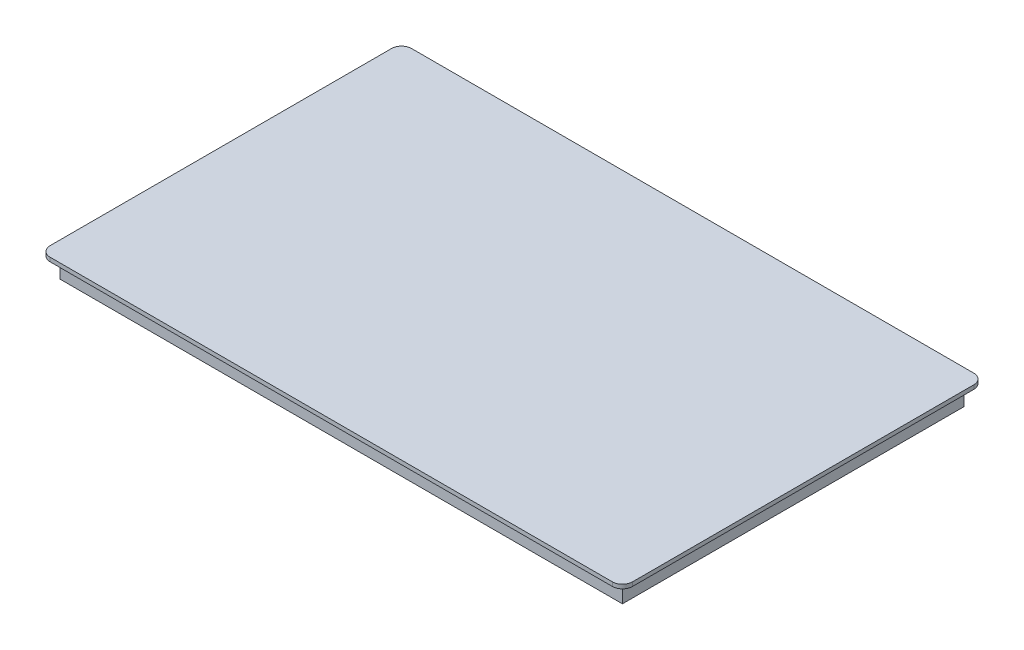
ISO-10303-21;
HEADER;
FILE_DESCRIPTION(('STEP AP214'),'2;1');
FILE_NAME('part.step','',(''),(''),'','','');
FILE_SCHEMA(('AUTOMOTIVE_DESIGN { 1 0 10303 214 1 1 1 1 }'));
ENDSEC;
DATA;
#1=APPLICATION_CONTEXT('core data for automotive mechanical design processes');
#2=APPLICATION_PROTOCOL_DEFINITION('international standard','automotive_design',2000,#1);
#3=PRODUCT_CONTEXT('',#1,'mechanical');
#4=PRODUCT('Part','Part','',(#3));
#5=PRODUCT_RELATED_PRODUCT_CATEGORY('part','',(#4));
#6=PRODUCT_DEFINITION_FORMATION('','',#4);
#7=PRODUCT_DEFINITION_CONTEXT('part definition',#1,'design');
#8=PRODUCT_DEFINITION('design','',#6,#7);
#9=PRODUCT_DEFINITION_SHAPE('','',#8);
#10=(LENGTH_UNIT() NAMED_UNIT(*) SI_UNIT(.MILLI.,.METRE.));
#11=(NAMED_UNIT(*) PLANE_ANGLE_UNIT() SI_UNIT($,.RADIAN.));
#12=(NAMED_UNIT(*) SI_UNIT($,.STERADIAN.) SOLID_ANGLE_UNIT());
#13=UNCERTAINTY_MEASURE_WITH_UNIT(LENGTH_MEASURE(1.E-05),#10,'distance_accuracy_value','');
#14=(GEOMETRIC_REPRESENTATION_CONTEXT(3) GLOBAL_UNCERTAINTY_ASSIGNED_CONTEXT((#13)) GLOBAL_UNIT_ASSIGNED_CONTEXT((#10,
#11,#12)) REPRESENTATION_CONTEXT('',''));
#15=CARTESIAN_POINT('',(0.,0.,0.));
#16=DIRECTION('',(0.,0.,1.));
#17=DIRECTION('',(1.,0.,0.));
#18=AXIS2_PLACEMENT_3D('',#15,#16,#17);
#19=CARTESIAN_POINT('',(0.,-1.,0.));
#20=DIRECTION('',(0.,1.,0.));
#21=DIRECTION('',(0.,0.,1.));
#22=AXIS2_PLACEMENT_3D('',#19,#20,#21);
#23=PLANE('',#22);
#24=DIRECTION('',(-1.,0.,0.));
#25=VECTOR('',#24,1.);
#26=CARTESIAN_POINT('',(-72.5,-1.,-45.));
#27=LINE('',#26,#25);
#28=CARTESIAN_POINT('',(70.,-1.,-45.));
#29=VERTEX_POINT('',#28);
#30=CARTESIAN_POINT('',(-70.,-1.,-45.));
#31=VERTEX_POINT('',#30);
#32=EDGE_CURVE('E263',#29,#31,#27,.T.);
#33=ORIENTED_EDGE('',*,*,#32,.F.);
#34=CARTESIAN_POINT('',(70.,-1.,-42.5));
#35=DIRECTION('',(0.,1.,0.));
#36=DIRECTION('',(0.,0.,1.));
#37=AXIS2_PLACEMENT_3D('',#34,#35,#36);
#38=CIRCLE('',#37,2.5);
#39=CARTESIAN_POINT('',(72.5,-1.,-42.5));
#40=VERTEX_POINT('',#39);
#41=EDGE_CURVE('E323',#29,#40,#38,.F.);
#42=ORIENTED_EDGE('',*,*,#41,.T.);
#43=DIRECTION('',(0.,0.,-1.));
#44=VECTOR('',#43,1.);
#45=CARTESIAN_POINT('',(72.5,-1.,-45.));
#46=LINE('',#45,#44);
#47=CARTESIAN_POINT('',(72.5000000000001,-1.,42.5));
#48=VERTEX_POINT('',#47);
#49=EDGE_CURVE('E259',#48,#40,#46,.T.);
#50=ORIENTED_EDGE('',*,*,#49,.F.);
#51=CARTESIAN_POINT('',(70.,-1.,42.5));
#52=DIRECTION('',(0.,1.,0.));
#53=DIRECTION('',(0.,0.,1.));
#54=AXIS2_PLACEMENT_3D('',#51,#52,#53);
#55=CIRCLE('',#54,2.5);
#56=CARTESIAN_POINT('',(70.,-1.,45.));
#57=VERTEX_POINT('',#56);
#58=EDGE_CURVE('E320',#48,#57,#55,.F.);
#59=ORIENTED_EDGE('',*,*,#58,.T.);
#60=DIRECTION('',(1.,0.,0.));
#61=VECTOR('',#60,1.);
#62=CARTESIAN_POINT('',(-72.4999999999999,-1.,45.));
#63=LINE('',#62,#61);
#64=CARTESIAN_POINT('',(-69.9999999999999,-1.,45.));
#65=VERTEX_POINT('',#64);
#66=EDGE_CURVE('E271',#65,#57,#63,.T.);
#67=ORIENTED_EDGE('',*,*,#66,.F.);
#68=CARTESIAN_POINT('',(-69.9999999999999,-1.,42.5));
#69=DIRECTION('',(0.,1.,0.));
#70=DIRECTION('',(0.,0.,1.));
#71=AXIS2_PLACEMENT_3D('',#68,#69,#70);
#72=CIRCLE('',#71,2.5);
#73=CARTESIAN_POINT('',(-72.4999999999999,-1.,42.5));
#74=VERTEX_POINT('',#73);
#75=EDGE_CURVE('E61',#65,#74,#72,.F.);
#76=ORIENTED_EDGE('',*,*,#75,.T.);
#77=DIRECTION('',(0.,0.,1.));
#78=VECTOR('',#77,1.);
#79=CARTESIAN_POINT('',(-72.5,-1.,-45.));
#80=LINE('',#79,#78);
#81=CARTESIAN_POINT('',(-72.5,-1.,-42.5));
#82=VERTEX_POINT('',#81);
#83=EDGE_CURVE('E268',#82,#74,#80,.T.);
#84=ORIENTED_EDGE('',*,*,#83,.F.);
#85=CARTESIAN_POINT('',(-70.,-1.,-42.5));
#86=DIRECTION('',(0.,1.,0.));
#87=DIRECTION('',(0.,0.,1.));
#88=AXIS2_PLACEMENT_3D('',#85,#86,#87);
#89=CIRCLE('',#88,2.5);
#90=EDGE_CURVE('E317',#82,#31,#89,.F.);
#91=ORIENTED_EDGE('',*,*,#90,.T.);
#92=EDGE_LOOP('',(#33,#42,#50,#59,#67,#76,#84,#91));
#93=FACE_BOUND('',#92,.T.);
#94=DIRECTION('',(0.,0.,1.));
#95=VECTOR('',#94,1.);
#96=CARTESIAN_POINT('',(70.,-1.,42.5));
#97=LINE('',#96,#95);
#98=CARTESIAN_POINT('',(70.,-1.,-42.5));
#99=VERTEX_POINT('',#98);
#100=CARTESIAN_POINT('',(70.,-1.,42.5));
#101=VERTEX_POINT('',#100);
#102=EDGE_CURVE('E180',#99,#101,#97,.T.);
#103=ORIENTED_EDGE('',*,*,#102,.F.);
#104=DIRECTION('',(1.,0.,0.));
#105=VECTOR('',#104,1.);
#106=CARTESIAN_POINT('',(-70.,-1.,-42.5));
#107=LINE('',#106,#105);
#108=CARTESIAN_POINT('',(-70.,-1.,-42.5));
#109=VERTEX_POINT('',#108);
#110=EDGE_CURVE('E219',#109,#99,#107,.T.);
#111=ORIENTED_EDGE('',*,*,#110,.F.);
#112=DIRECTION('',(0.,0.,-1.));
#113=VECTOR('',#112,1.);
#114=CARTESIAN_POINT('',(-70.,-1.,42.5));
#115=LINE('',#114,#113);
#116=CARTESIAN_POINT('',(-70.,-1.,42.5));
#117=VERTEX_POINT('',#116);
#118=EDGE_CURVE('E236',#117,#109,#115,.T.);
#119=ORIENTED_EDGE('',*,*,#118,.F.);
#120=DIRECTION('',(-1.,0.,0.));
#121=VECTOR('',#120,1.);
#122=CARTESIAN_POINT('',(-70.,-1.,42.5));
#123=LINE('',#122,#121);
#124=EDGE_CURVE('E232',#101,#117,#123,.T.);
#125=ORIENTED_EDGE('',*,*,#124,.F.);
#126=EDGE_LOOP('',(#103,#111,#119,#125));
#127=FACE_BOUND('',#126,.T.);
#128=ADVANCED_FACE('F45',(#93,#127),#23,.F.);
#129=CARTESIAN_POINT('',(72.5,-1.,-45.));
#130=DIRECTION('',(1.,0.,0.));
#131=DIRECTION('',(0.,0.,-1.));
#132=AXIS2_PLACEMENT_3D('',#129,#130,#131);
#133=PLANE('',#132);
#134=ORIENTED_EDGE('',*,*,#49,.T.);
#135=DIRECTION('',(0.,1.,0.));
#136=VECTOR('',#135,1.);
#137=CARTESIAN_POINT('',(72.5,-1.,-42.5));
#138=LINE('',#137,#136);
#139=CARTESIAN_POINT('',(72.5,0.,-42.5));
#140=VERTEX_POINT('',#139);
#141=EDGE_CURVE('E292',#40,#140,#138,.T.);
#142=ORIENTED_EDGE('',*,*,#141,.T.);
#143=DIRECTION('',(0.,0.,-1.));
#144=VECTOR('',#143,1.);
#145=CARTESIAN_POINT('',(72.5,0.,-45.));
#146=LINE('',#145,#144);
#147=CARTESIAN_POINT('',(72.5000000000001,0.,42.5));
#148=VERTEX_POINT('',#147);
#149=EDGE_CURVE('E258',#148,#140,#146,.T.);
#150=ORIENTED_EDGE('',*,*,#149,.F.);
#151=DIRECTION('',(0.,1.,0.));
#152=VECTOR('',#151,1.);
#153=CARTESIAN_POINT('',(72.5000000000001,-1.,42.5));
#154=LINE('',#153,#152);
#155=EDGE_CURVE('E275',#148,#48,#154,.F.);
#156=ORIENTED_EDGE('',*,*,#155,.T.);
#157=EDGE_LOOP('',(#134,#142,#150,#156));
#158=FACE_BOUND('',#157,.T.);
#159=ADVANCED_FACE('F357',(#158),#133,.T.);
#160=CARTESIAN_POINT('',(-72.4999999999999,-1.,45.));
#161=DIRECTION('',(0.,0.,1.));
#162=DIRECTION('',(1.,0.,0.));
#163=AXIS2_PLACEMENT_3D('',#160,#161,#162);
#164=PLANE('',#163);
#165=ORIENTED_EDGE('',*,*,#66,.T.);
#166=DIRECTION('',(0.,1.,0.));
#167=VECTOR('',#166,1.);
#168=CARTESIAN_POINT('',(70.,-1.,45.));
#169=LINE('',#168,#167);
#170=CARTESIAN_POINT('',(70.,0.,45.));
#171=VERTEX_POINT('',#170);
#172=EDGE_CURVE('E329',#57,#171,#169,.T.);
#173=ORIENTED_EDGE('',*,*,#172,.T.);
#174=DIRECTION('',(1.,0.,0.));
#175=VECTOR('',#174,1.);
#176=CARTESIAN_POINT('',(-72.4999999999999,0.,45.));
#177=LINE('',#176,#175);
#178=CARTESIAN_POINT('',(-69.9999999999999,0.,45.));
#179=VERTEX_POINT('',#178);
#180=EDGE_CURVE('E264',#179,#171,#177,.T.);
#181=ORIENTED_EDGE('',*,*,#180,.F.);
#182=DIRECTION('',(0.,1.,0.));
#183=VECTOR('',#182,1.);
#184=CARTESIAN_POINT('',(-69.9999999999999,-1.,45.));
#185=LINE('',#184,#183);
#186=EDGE_CURVE('E326',#179,#65,#185,.F.);
#187=ORIENTED_EDGE('',*,*,#186,.T.);
#188=EDGE_LOOP('',(#165,#173,#181,#187));
#189=FACE_BOUND('',#188,.T.);
#190=ADVANCED_FACE('F364',(#189),#164,.T.);
#191=CARTESIAN_POINT('',(-72.5,-1.,-45.));
#192=DIRECTION('',(-1.,0.,0.));
#193=DIRECTION('',(0.,0.,1.));
#194=AXIS2_PLACEMENT_3D('',#191,#192,#193);
#195=PLANE('',#194);
#196=DIRECTION('',(0.,0.,1.));
#197=VECTOR('',#196,1.);
#198=CARTESIAN_POINT('',(-72.5,0.,-45.));
#199=LINE('',#198,#197);
#200=CARTESIAN_POINT('',(-72.5,0.,-42.5));
#201=VERTEX_POINT('',#200);
#202=CARTESIAN_POINT('',(-72.4999999999999,0.,42.5));
#203=VERTEX_POINT('',#202);
#204=EDGE_CURVE('E283',#201,#203,#199,.T.);
#205=ORIENTED_EDGE('',*,*,#204,.F.);
#206=DIRECTION('',(0.,1.,0.));
#207=VECTOR('',#206,1.);
#208=CARTESIAN_POINT('',(-72.5,-1.,-42.5));
#209=LINE('',#208,#207);
#210=EDGE_CURVE('E11',#201,#82,#209,.F.);
#211=ORIENTED_EDGE('',*,*,#210,.T.);
#212=ORIENTED_EDGE('',*,*,#83,.T.);
#213=DIRECTION('',(0.,1.,0.));
#214=VECTOR('',#213,1.);
#215=CARTESIAN_POINT('',(-72.4999999999999,-1.,42.5));
#216=LINE('',#215,#214);
#217=EDGE_CURVE('E54',#74,#203,#216,.T.);
#218=ORIENTED_EDGE('',*,*,#217,.T.);
#219=EDGE_LOOP('',(#205,#211,#212,#218));
#220=FACE_BOUND('',#219,.T.);
#221=ADVANCED_FACE('F335',(#220),#195,.T.);
#222=CARTESIAN_POINT('',(-72.5,-1.,-45.));
#223=DIRECTION('',(0.,0.,-1.));
#224=DIRECTION('',(-1.,0.,0.));
#225=AXIS2_PLACEMENT_3D('',#222,#223,#224);
#226=PLANE('',#225);
#227=DIRECTION('',(-1.,0.,0.));
#228=VECTOR('',#227,1.);
#229=CARTESIAN_POINT('',(-72.5,0.,-45.));
#230=LINE('',#229,#228);
#231=CARTESIAN_POINT('',(70.,0.,-45.));
#232=VERTEX_POINT('',#231);
#233=CARTESIAN_POINT('',(-70.,0.,-45.));
#234=VERTEX_POINT('',#233);
#235=EDGE_CURVE('E279',#232,#234,#230,.T.);
#236=ORIENTED_EDGE('',*,*,#235,.F.);
#237=DIRECTION('',(0.,1.,0.));
#238=VECTOR('',#237,1.);
#239=CARTESIAN_POINT('',(70.,-1.,-45.));
#240=LINE('',#239,#238);
#241=EDGE_CURVE('E312',#232,#29,#240,.F.);
#242=ORIENTED_EDGE('',*,*,#241,.T.);
#243=ORIENTED_EDGE('',*,*,#32,.T.);
#244=DIRECTION('',(0.,1.,0.));
#245=VECTOR('',#244,1.);
#246=CARTESIAN_POINT('',(-70.,-1.,-45.));
#247=LINE('',#246,#245);
#248=EDGE_CURVE('E308',#31,#234,#247,.T.);
#249=ORIENTED_EDGE('',*,*,#248,.T.);
#250=EDGE_LOOP('',(#236,#242,#243,#249));
#251=FACE_BOUND('',#250,.T.);
#252=ADVANCED_FACE('F346',(#251),#226,.T.);
#253=CARTESIAN_POINT('',(0.,0.,0.));
#254=DIRECTION('',(0.,1.,0.));
#255=DIRECTION('',(0.,0.,1.));
#256=AXIS2_PLACEMENT_3D('',#253,#254,#255);
#257=PLANE('',#256);
#258=ORIENTED_EDGE('',*,*,#149,.T.);
#259=CARTESIAN_POINT('',(70.,0.,-42.5));
#260=DIRECTION('',(0.,1.,0.));
#261=DIRECTION('',(0.,0.,1.));
#262=AXIS2_PLACEMENT_3D('',#259,#260,#261);
#263=CIRCLE('',#262,2.5);
#264=EDGE_CURVE('E305',#140,#232,#263,.T.);
#265=ORIENTED_EDGE('',*,*,#264,.T.);
#266=ORIENTED_EDGE('',*,*,#235,.T.);
#267=CARTESIAN_POINT('',(-70.,0.,-42.5));
#268=DIRECTION('',(0.,1.,0.));
#269=DIRECTION('',(0.,0.,1.));
#270=AXIS2_PLACEMENT_3D('',#267,#268,#269);
#271=CIRCLE('',#270,2.5);
#272=EDGE_CURVE('E299',#234,#201,#271,.T.);
#273=ORIENTED_EDGE('',*,*,#272,.T.);
#274=ORIENTED_EDGE('',*,*,#204,.T.);
#275=CARTESIAN_POINT('',(-69.9999999999999,0.,42.5));
#276=DIRECTION('',(0.,1.,0.));
#277=DIRECTION('',(0.,0.,1.));
#278=AXIS2_PLACEMENT_3D('',#275,#276,#277);
#279=CIRCLE('',#278,2.5);
#280=EDGE_CURVE('E296',#203,#179,#279,.T.);
#281=ORIENTED_EDGE('',*,*,#280,.T.);
#282=ORIENTED_EDGE('',*,*,#180,.T.);
#283=CARTESIAN_POINT('',(70.,0.,42.5));
#284=DIRECTION('',(0.,1.,0.));
#285=DIRECTION('',(0.,0.,1.));
#286=AXIS2_PLACEMENT_3D('',#283,#284,#285);
#287=CIRCLE('',#286,2.5);
#288=EDGE_CURVE('E302',#171,#148,#287,.T.);
#289=ORIENTED_EDGE('',*,*,#288,.T.);
#290=EDGE_LOOP('',(#258,#265,#266,#273,#274,#281,#282,#289));
#291=FACE_BOUND('',#290,.T.);
#292=ADVANCED_FACE('F338',(#291),#257,.T.);
#293=CARTESIAN_POINT('',(0.,-6.,0.));
#294=DIRECTION('',(0.,-1.,0.));
#295=DIRECTION('',(0.,0.,-1.));
#296=AXIS2_PLACEMENT_3D('',#293,#294,#295);
#297=PLANE('',#296);
#298=DIRECTION('',(0.,0.,1.));
#299=VECTOR('',#298,1.);
#300=CARTESIAN_POINT('',(70.,-6.,42.5));
#301=LINE('',#300,#299);
#302=CARTESIAN_POINT('',(70.,-6.,-42.5));
#303=VERTEX_POINT('',#302);
#304=CARTESIAN_POINT('',(70.,-6.,42.5));
#305=VERTEX_POINT('',#304);
#306=EDGE_CURVE('E214',#303,#305,#301,.T.);
#307=ORIENTED_EDGE('',*,*,#306,.T.);
#308=DIRECTION('',(-1.,0.,0.));
#309=VECTOR('',#308,1.);
#310=CARTESIAN_POINT('',(-70.,-6.,42.5));
#311=LINE('',#310,#309);
#312=CARTESIAN_POINT('',(-70.,-6.,42.5));
#313=VERTEX_POINT('',#312);
#314=EDGE_CURVE('E218',#305,#313,#311,.T.);
#315=ORIENTED_EDGE('',*,*,#314,.T.);
#316=DIRECTION('',(0.,0.,-1.));
#317=VECTOR('',#316,1.);
#318=CARTESIAN_POINT('',(-70.,-6.,42.5));
#319=LINE('',#318,#317);
#320=CARTESIAN_POINT('',(-70.,-6.,-42.5));
#321=VERTEX_POINT('',#320);
#322=EDGE_CURVE('E222',#313,#321,#319,.T.);
#323=ORIENTED_EDGE('',*,*,#322,.T.);
#324=DIRECTION('',(1.,0.,0.));
#325=VECTOR('',#324,1.);
#326=CARTESIAN_POINT('',(-70.,-6.,-42.5));
#327=LINE('',#326,#325);
#328=EDGE_CURVE('E225',#321,#303,#327,.T.);
#329=ORIENTED_EDGE('',*,*,#328,.T.);
#330=EDGE_LOOP('',(#307,#315,#323,#329));
#331=FACE_BOUND('',#330,.T.);
#332=DIRECTION('',(1.,0.,0.));
#333=VECTOR('',#332,1.);
#334=CARTESIAN_POINT('',(-67.5,-6.,-40.));
#335=LINE('',#334,#333);
#336=CARTESIAN_POINT('',(-67.5,-6.,-40.));
#337=VERTEX_POINT('',#336);
#338=CARTESIAN_POINT('',(67.5,-6.,-40.));
#339=VERTEX_POINT('',#338);
#340=EDGE_CURVE('E171',#337,#339,#335,.T.);
#341=ORIENTED_EDGE('',*,*,#340,.F.);
#342=DIRECTION('',(0.,0.,-1.));
#343=VECTOR('',#342,1.);
#344=CARTESIAN_POINT('',(-67.5,-6.,40.));
#345=LINE('',#344,#343);
#346=CARTESIAN_POINT('',(-67.5,-6.,40.));
#347=VERTEX_POINT('',#346);
#348=EDGE_CURVE('E160',#347,#337,#345,.T.);
#349=ORIENTED_EDGE('',*,*,#348,.F.);
#350=DIRECTION('',(-1.,0.,0.));
#351=VECTOR('',#350,1.);
#352=CARTESIAN_POINT('',(-67.5,-6.,40.));
#353=LINE('',#352,#351);
#354=CARTESIAN_POINT('',(67.5,-6.,40.));
#355=VERTEX_POINT('',#354);
#356=EDGE_CURVE('E190',#355,#347,#353,.T.);
#357=ORIENTED_EDGE('',*,*,#356,.F.);
#358=DIRECTION('',(0.,0.,1.));
#359=VECTOR('',#358,1.);
#360=CARTESIAN_POINT('',(67.5,-6.,40.));
#361=LINE('',#360,#359);
#362=EDGE_CURVE('E186',#339,#355,#361,.T.);
#363=ORIENTED_EDGE('',*,*,#362,.F.);
#364=EDGE_LOOP('',(#341,#349,#357,#363));
#365=FACE_BOUND('',#364,.T.);
#366=ADVANCED_FACE('F184',(#331,#365),#297,.T.);
#367=CARTESIAN_POINT('',(70.,-6.,42.5));
#368=DIRECTION('',(-1.,0.,0.));
#369=DIRECTION('',(0.,0.,1.));
#370=AXIS2_PLACEMENT_3D('',#367,#368,#369);
#371=PLANE('',#370);
#372=ORIENTED_EDGE('',*,*,#102,.T.);
#373=DIRECTION('',(0.,1.,0.));
#374=VECTOR('',#373,1.);
#375=CARTESIAN_POINT('',(70.,-6.,42.5));
#376=LINE('',#375,#374);
#377=EDGE_CURVE('E254',#305,#101,#376,.T.);
#378=ORIENTED_EDGE('',*,*,#377,.F.);
#379=ORIENTED_EDGE('',*,*,#306,.F.);
#380=DIRECTION('',(0.,1.,0.));
#381=VECTOR('',#380,1.);
#382=CARTESIAN_POINT('',(70.,-6.,-42.5));
#383=LINE('',#382,#381);
#384=EDGE_CURVE('E228',#303,#99,#383,.T.);
#385=ORIENTED_EDGE('',*,*,#384,.T.);
#386=EDGE_LOOP('',(#372,#378,#379,#385));
#387=FACE_BOUND('',#386,.T.);
#388=ADVANCED_FACE('F405',(#387),#371,.F.);
#389=CARTESIAN_POINT('',(-70.,-6.,42.5));
#390=DIRECTION('',(0.,0.,-1.));
#391=DIRECTION('',(-1.,0.,0.));
#392=AXIS2_PLACEMENT_3D('',#389,#390,#391);
#393=PLANE('',#392);
#394=ORIENTED_EDGE('',*,*,#124,.T.);
#395=DIRECTION('',(0.,1.,0.));
#396=VECTOR('',#395,1.);
#397=CARTESIAN_POINT('',(-70.,-6.,42.5));
#398=LINE('',#397,#396);
#399=EDGE_CURVE('E250',#313,#117,#398,.T.);
#400=ORIENTED_EDGE('',*,*,#399,.F.);
#401=ORIENTED_EDGE('',*,*,#314,.F.);
#402=ORIENTED_EDGE('',*,*,#377,.T.);
#403=EDGE_LOOP('',(#394,#400,#401,#402));
#404=FACE_BOUND('',#403,.T.);
#405=ADVANCED_FACE('F413',(#404),#393,.F.);
#406=CARTESIAN_POINT('',(-70.,-6.,42.5));
#407=DIRECTION('',(1.,0.,0.));
#408=DIRECTION('',(0.,0.,-1.));
#409=AXIS2_PLACEMENT_3D('',#406,#407,#408);
#410=PLANE('',#409);
#411=ORIENTED_EDGE('',*,*,#118,.T.);
#412=DIRECTION('',(0.,1.,0.));
#413=VECTOR('',#412,1.);
#414=CARTESIAN_POINT('',(-70.,-6.,-42.5));
#415=LINE('',#414,#413);
#416=EDGE_CURVE('E246',#321,#109,#415,.T.);
#417=ORIENTED_EDGE('',*,*,#416,.F.);
#418=ORIENTED_EDGE('',*,*,#322,.F.);
#419=ORIENTED_EDGE('',*,*,#399,.T.);
#420=EDGE_LOOP('',(#411,#417,#418,#419));
#421=FACE_BOUND('',#420,.T.);
#422=ADVANCED_FACE('F409',(#421),#410,.F.);
#423=CARTESIAN_POINT('',(-70.,-6.,-42.5));
#424=DIRECTION('',(0.,0.,1.));
#425=DIRECTION('',(1.,0.,0.));
#426=AXIS2_PLACEMENT_3D('',#423,#424,#425);
#427=PLANE('',#426);
#428=ORIENTED_EDGE('',*,*,#110,.T.);
#429=ORIENTED_EDGE('',*,*,#384,.F.);
#430=ORIENTED_EDGE('',*,*,#328,.F.);
#431=ORIENTED_EDGE('',*,*,#416,.T.);
#432=EDGE_LOOP('',(#428,#429,#430,#431));
#433=FACE_BOUND('',#432,.T.);
#434=ADVANCED_FACE('F402',(#433),#427,.F.);
#435=CARTESIAN_POINT('',(-67.5,-6.,40.));
#436=DIRECTION('',(1.,0.,0.));
#437=DIRECTION('',(0.,0.,-1.));
#438=AXIS2_PLACEMENT_3D('',#435,#436,#437);
#439=PLANE('',#438);
#440=DIRECTION('',(0.,0.,-1.));
#441=VECTOR('',#440,1.);
#442=CARTESIAN_POINT('',(-67.5,-1.,40.));
#443=LINE('',#442,#441);
#444=CARTESIAN_POINT('',(-67.5,-1.,40.));
#445=VERTEX_POINT('',#444);
#446=CARTESIAN_POINT('',(-67.5,-1.,-40.));
#447=VERTEX_POINT('',#446);
#448=EDGE_CURVE('E195',#445,#447,#443,.T.);
#449=ORIENTED_EDGE('',*,*,#448,.F.);
#450=DIRECTION('',(0.,1.,0.));
#451=VECTOR('',#450,1.);
#452=CARTESIAN_POINT('',(-67.5,-6.,40.));
#453=LINE('',#452,#451);
#454=EDGE_CURVE('E166',#347,#445,#453,.T.);
#455=ORIENTED_EDGE('',*,*,#454,.F.);
#456=ORIENTED_EDGE('',*,*,#348,.T.);
#457=DIRECTION('',(0.,1.,0.));
#458=VECTOR('',#457,1.);
#459=CARTESIAN_POINT('',(-67.5,-6.,-40.));
#460=LINE('',#459,#458);
#461=EDGE_CURVE('E164',#337,#447,#460,.T.);
#462=ORIENTED_EDGE('',*,*,#461,.T.);
#463=EDGE_LOOP('',(#449,#455,#456,#462));
#464=FACE_BOUND('',#463,.T.);
#465=ADVANCED_FACE('F163',(#464),#439,.T.);
#466=CARTESIAN_POINT('',(-67.5,-6.,-40.));
#467=DIRECTION('',(0.,0.,1.));
#468=DIRECTION('',(1.,0.,0.));
#469=AXIS2_PLACEMENT_3D('',#466,#467,#468);
#470=PLANE('',#469);
#471=DIRECTION('',(1.,0.,0.));
#472=VECTOR('',#471,1.);
#473=CARTESIAN_POINT('',(-67.5,-1.,-40.));
#474=LINE('',#473,#472);
#475=CARTESIAN_POINT('',(67.5,-1.,-40.));
#476=VERTEX_POINT('',#475);
#477=EDGE_CURVE('E178',#447,#476,#474,.T.);
#478=ORIENTED_EDGE('',*,*,#477,.F.);
#479=ORIENTED_EDGE('',*,*,#461,.F.);
#480=ORIENTED_EDGE('',*,*,#340,.T.);
#481=DIRECTION('',(0.,1.,0.));
#482=VECTOR('',#481,1.);
#483=CARTESIAN_POINT('',(67.5,-6.,-40.));
#484=LINE('',#483,#482);
#485=EDGE_CURVE('E181',#339,#476,#484,.T.);
#486=ORIENTED_EDGE('',*,*,#485,.T.);
#487=EDGE_LOOP('',(#478,#479,#480,#486));
#488=FACE_BOUND('',#487,.T.);
#489=ADVANCED_FACE('F175',(#488),#470,.T.);
#490=CARTESIAN_POINT('',(67.5,-6.,40.));
#491=DIRECTION('',(-1.,0.,0.));
#492=DIRECTION('',(0.,0.,1.));
#493=AXIS2_PLACEMENT_3D('',#490,#491,#492);
#494=PLANE('',#493);
#495=DIRECTION('',(0.,0.,1.));
#496=VECTOR('',#495,1.);
#497=CARTESIAN_POINT('',(67.5,-1.,40.));
#498=LINE('',#497,#496);
#499=CARTESIAN_POINT('',(67.5,-1.,40.));
#500=VERTEX_POINT('',#499);
#501=EDGE_CURVE('E200',#476,#500,#498,.T.);
#502=ORIENTED_EDGE('',*,*,#501,.F.);
#503=ORIENTED_EDGE('',*,*,#485,.F.);
#504=ORIENTED_EDGE('',*,*,#362,.T.);
#505=DIRECTION('',(0.,1.,0.));
#506=VECTOR('',#505,1.);
#507=CARTESIAN_POINT('',(67.5,-6.,40.));
#508=LINE('',#507,#506);
#509=EDGE_CURVE('E209',#355,#500,#508,.T.);
#510=ORIENTED_EDGE('',*,*,#509,.T.);
#511=EDGE_LOOP('',(#502,#503,#504,#510));
#512=FACE_BOUND('',#511,.T.);
#513=ADVANCED_FACE('F387',(#512),#494,.T.);
#514=CARTESIAN_POINT('',(-67.5,-6.,40.));
#515=DIRECTION('',(0.,0.,-1.));
#516=DIRECTION('',(-1.,0.,0.));
#517=AXIS2_PLACEMENT_3D('',#514,#515,#516);
#518=PLANE('',#517);
#519=DIRECTION('',(-1.,0.,0.));
#520=VECTOR('',#519,1.);
#521=CARTESIAN_POINT('',(-67.5,-1.,40.));
#522=LINE('',#521,#520);
#523=EDGE_CURVE('E172',#500,#445,#522,.T.);
#524=ORIENTED_EDGE('',*,*,#523,.F.);
#525=ORIENTED_EDGE('',*,*,#509,.F.);
#526=ORIENTED_EDGE('',*,*,#356,.T.);
#527=ORIENTED_EDGE('',*,*,#454,.T.);
#528=EDGE_LOOP('',(#524,#525,#526,#527));
#529=FACE_BOUND('',#528,.T.);
#530=ADVANCED_FACE('F380',(#529),#518,.T.);
#531=ORIENTED_EDGE('',*,*,#523,.T.);
#532=ORIENTED_EDGE('',*,*,#448,.T.);
#533=ORIENTED_EDGE('',*,*,#477,.T.);
#534=ORIENTED_EDGE('',*,*,#501,.T.);
#535=EDGE_LOOP('',(#531,#532,#533,#534));
#536=FACE_BOUND('',#535,.T.);
#537=ADVANCED_FACE('F372',(#536),#23,.F.);
#538=CARTESIAN_POINT('',(70.,-1.,-42.5));
#539=DIRECTION('',(0.,1.,0.));
#540=DIRECTION('',(0.,0.,1.));
#541=AXIS2_PLACEMENT_3D('',#538,#539,#540);
#542=CYLINDRICAL_SURFACE('',#541,2.5);
#543=ORIENTED_EDGE('',*,*,#41,.F.);
#544=ORIENTED_EDGE('',*,*,#241,.F.);
#545=ORIENTED_EDGE('',*,*,#264,.F.);
#546=ORIENTED_EDGE('',*,*,#141,.F.);
#547=EDGE_LOOP('',(#543,#544,#545,#546));
#548=FACE_BOUND('',#547,.T.);
#549=ADVANCED_FACE('F354',(#548),#542,.T.);
#550=CARTESIAN_POINT('',(70.,-1.,42.5));
#551=DIRECTION('',(0.,1.,0.));
#552=DIRECTION('',(0.,0.,1.));
#553=AXIS2_PLACEMENT_3D('',#550,#551,#552);
#554=CYLINDRICAL_SURFACE('',#553,2.5);
#555=ORIENTED_EDGE('',*,*,#58,.F.);
#556=ORIENTED_EDGE('',*,*,#155,.F.);
#557=ORIENTED_EDGE('',*,*,#288,.F.);
#558=ORIENTED_EDGE('',*,*,#172,.F.);
#559=EDGE_LOOP('',(#555,#556,#557,#558));
#560=FACE_BOUND('',#559,.T.);
#561=ADVANCED_FACE('F362',(#560),#554,.T.);
#562=CARTESIAN_POINT('',(-70.,-1.,-42.5));
#563=DIRECTION('',(0.,1.,0.));
#564=DIRECTION('',(0.,0.,1.));
#565=AXIS2_PLACEMENT_3D('',#562,#563,#564);
#566=CYLINDRICAL_SURFACE('',#565,2.5);
#567=ORIENTED_EDGE('',*,*,#90,.F.);
#568=ORIENTED_EDGE('',*,*,#210,.F.);
#569=ORIENTED_EDGE('',*,*,#272,.F.);
#570=ORIENTED_EDGE('',*,*,#248,.F.);
#571=EDGE_LOOP('',(#567,#568,#569,#570));
#572=FACE_BOUND('',#571,.T.);
#573=ADVANCED_FACE('F344',(#572),#566,.T.);
#574=CARTESIAN_POINT('',(-69.9999999999999,-1.,42.5));
#575=DIRECTION('',(0.,1.,0.));
#576=DIRECTION('',(0.,0.,1.));
#577=AXIS2_PLACEMENT_3D('',#574,#575,#576);
#578=CYLINDRICAL_SURFACE('',#577,2.5);
#579=ORIENTED_EDGE('',*,*,#75,.F.);
#580=ORIENTED_EDGE('',*,*,#186,.F.);
#581=ORIENTED_EDGE('',*,*,#280,.F.);
#582=ORIENTED_EDGE('',*,*,#217,.F.);
#583=EDGE_LOOP('',(#579,#580,#581,#582));
#584=FACE_BOUND('',#583,.T.);
#585=ADVANCED_FACE('F47',(#584),#578,.T.);
#586=CLOSED_SHELL('',(#128,#159,#190,#221,#252,#292,#366,#388,#405,#422,#434,#465,#489,#513,
#530,#537,#549,#561,#573,#585));
#587=MANIFOLD_SOLID_BREP('B2',#586);
#588=ADVANCED_BREP_SHAPE_REPRESENTATION('',(#18,#587),#14);
#589=SHAPE_DEFINITION_REPRESENTATION(#9,#588);
ENDSEC;
END-ISO-10303-21;
